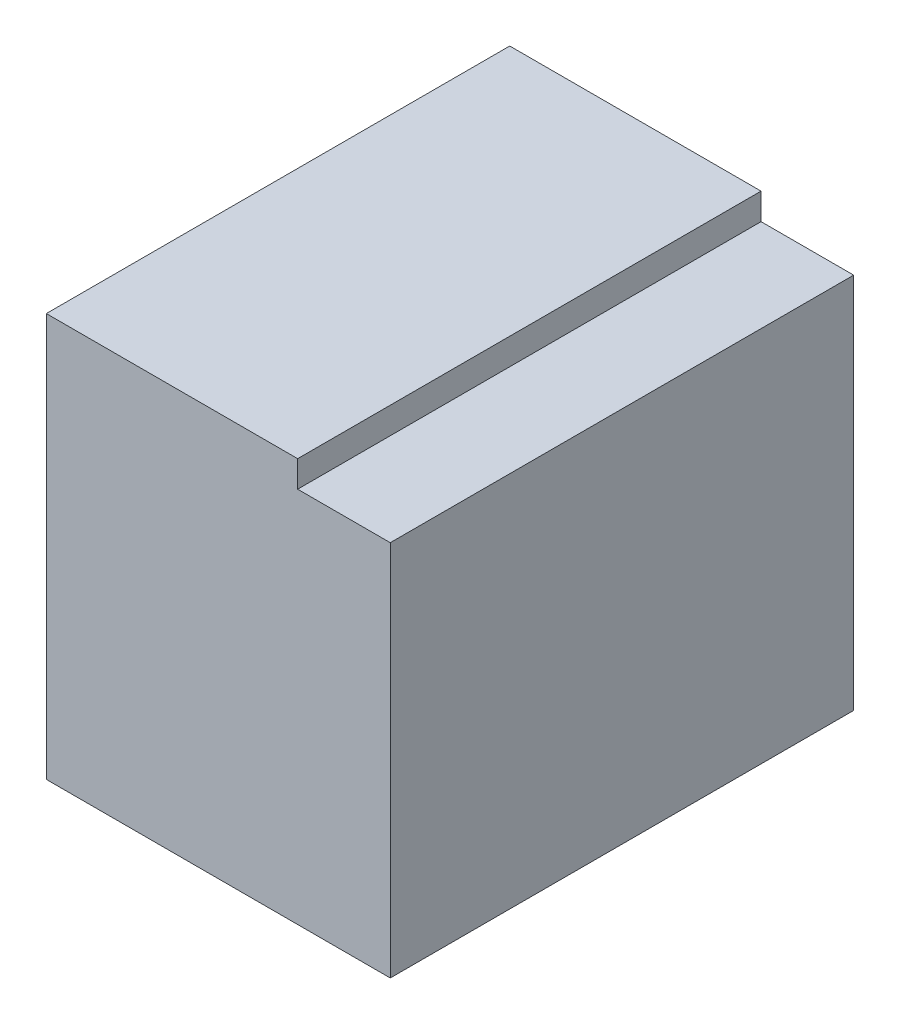
ISO-10303-21;
HEADER;
FILE_DESCRIPTION(('STEP AP214'),'2;1');
FILE_NAME('part.step','',(''),(''),'','','');
FILE_SCHEMA(('AUTOMOTIVE_DESIGN { 1 0 10303 214 1 1 1 1 }'));
ENDSEC;
DATA;
#1=APPLICATION_CONTEXT('core data for automotive mechanical design processes');
#2=APPLICATION_PROTOCOL_DEFINITION('international standard','automotive_design',2000,#1);
#3=PRODUCT_CONTEXT('',#1,'mechanical');
#4=PRODUCT('Part','Part','',(#3));
#5=PRODUCT_RELATED_PRODUCT_CATEGORY('part','',(#4));
#6=PRODUCT_DEFINITION_FORMATION('','',#4);
#7=PRODUCT_DEFINITION_CONTEXT('part definition',#1,'design');
#8=PRODUCT_DEFINITION('design','',#6,#7);
#9=PRODUCT_DEFINITION_SHAPE('','',#8);
#10=(LENGTH_UNIT() NAMED_UNIT(*) SI_UNIT(.MILLI.,.METRE.));
#11=(NAMED_UNIT(*) PLANE_ANGLE_UNIT() SI_UNIT($,.RADIAN.));
#12=(NAMED_UNIT(*) SI_UNIT($,.STERADIAN.) SOLID_ANGLE_UNIT());
#13=UNCERTAINTY_MEASURE_WITH_UNIT(LENGTH_MEASURE(1.E-05),#10,'distance_accuracy_value','');
#14=(GEOMETRIC_REPRESENTATION_CONTEXT(3) GLOBAL_UNCERTAINTY_ASSIGNED_CONTEXT((#13)) GLOBAL_UNIT_ASSIGNED_CONTEXT((#10,
#11,#12)) REPRESENTATION_CONTEXT('',''));
#15=CARTESIAN_POINT('',(0.,0.,0.));
#16=DIRECTION('',(0.,0.,1.));
#17=DIRECTION('',(1.,0.,0.));
#18=AXIS2_PLACEMENT_3D('',#15,#16,#17);
#19=CARTESIAN_POINT('',(-74.98499366421,-2.051384398449,-41.29331973764));
#20=DIRECTION('',(1.,-1.338607343168E-12,0.));
#21=DIRECTION('',(1.338607343168E-12,1.,0.));
#22=AXIS2_PLACEMENT_3D('',#19,#20,#21);
#23=PLANE('',#22);
#24=DIRECTION('',(0.,0.,1.));
#25=VECTOR('',#24,1.);
#26=CARTESIAN_POINT('',(-74.98499366421,-2.126384400525,-44.48106509227));
#27=LINE('',#26,#25);
#28=CARTESIAN_POINT('',(-74.98499366421,-2.126384400524,-47.0733197376419));
#29=VERTEX_POINT('',#28);
#30=CARTESIAN_POINT('',(-74.9849936642101,-2.12638440052275,-47.4236397376319));
#31=VERTEX_POINT('',#30);
#32=EDGE_CURVE('E79',#29,#31,#27,.F.);
#33=ORIENTED_EDGE('',*,*,#32,.T.);
#34=DIRECTION('',(0.,1.,-1.798143292204E-12));
#35=VECTOR('',#34,1.);
#36=CARTESIAN_POINT('',(-74.98499366421,-0.806384399449,-47.42363973764));
#37=LINE('',#36,#35);
#38=CARTESIAN_POINT('',(-74.9849936642099,-1.841385159389,-47.423639737432));
#39=VERTEX_POINT('',#38);
#40=EDGE_CURVE('E78',#39,#31,#37,.F.);
#41=ORIENTED_EDGE('',*,*,#40,.F.);
#42=DIRECTION('',(0.,0.,-1.));
#43=VECTOR('',#42,1.);
#44=CARTESIAN_POINT('',(-74.98499366421,-1.841385122797,-47.24863973798));
#45=LINE('',#44,#43);
#46=CARTESIAN_POINT('',(-74.9849936642099,-1.8413851696845,-47.073319737642));
#47=VERTEX_POINT('',#46);
#48=EDGE_CURVE('E19',#39,#47,#45,.F.);
#49=ORIENTED_EDGE('',*,*,#48,.T.);
#50=DIRECTION('',(0.,-1.,1.798143292204E-12));
#51=VECTOR('',#50,1.);
#52=CARTESIAN_POINT('',(-74.98499366421,-0.806384399451,-47.07331973765));
#53=LINE('',#52,#51);
#54=EDGE_CURVE('E96',#29,#47,#53,.F.);
#55=ORIENTED_EDGE('',*,*,#54,.F.);
#56=EDGE_LOOP('',(#33,#41,#49,#55));
#57=FACE_BOUND('',#56,.T.);
#58=ADVANCED_FACE('F16',(#57),#23,.T.);
#59=CARTESIAN_POINT('',(-72.39500445623,-1.841385122797,-47.24863973798));
#60=DIRECTION('',(0.,-1.,0.));
#61=DIRECTION('',(0.,0.,-1.));
#62=AXIS2_PLACEMENT_3D('',#59,#60,#61);
#63=PLANE('',#62);
#64=DIRECTION('',(1.,0.,0.));
#65=VECTOR('',#64,1.);
#66=CARTESIAN_POINT('',(-74.98500392881,-1.841385208066,-47.4236397376381));
#67=LINE('',#66,#65);
#68=CARTESIAN_POINT('',(-75.0550044696225,-1.8413851654315,-47.4236397373045));
#69=VERTEX_POINT('',#68);
#70=EDGE_CURVE('E66',#69,#39,#67,.T.);
#71=ORIENTED_EDGE('',*,*,#70,.F.);
#72=DIRECTION('',(0.,0.,1.));
#73=VECTOR('',#72,1.);
#74=CARTESIAN_POINT('',(-75.05500447043,-1.841385208066,-47.24863973798));
#75=LINE('',#74,#73);
#76=CARTESIAN_POINT('',(-75.05500447043,-1.84138516045225,-47.073319737642));
#77=VERTEX_POINT('',#76);
#78=EDGE_CURVE('E76',#69,#77,#75,.T.);
#79=ORIENTED_EDGE('',*,*,#78,.T.);
#80=DIRECTION('',(1.,0.,0.));
#81=VECTOR('',#80,1.);
#82=CARTESIAN_POINT('',(-73.12019237886,-1.841385188149,-47.0733197376481));
#83=LINE('',#82,#81);
#84=EDGE_CURVE('E72',#47,#77,#83,.F.);
#85=ORIENTED_EDGE('',*,*,#84,.F.);
#86=ORIENTED_EDGE('',*,*,#48,.F.);
#87=EDGE_LOOP('',(#71,#79,#85,#86));
#88=FACE_BOUND('',#87,.T.);
#89=ADVANCED_FACE('F70',(#88),#63,.F.);
#90=CARTESIAN_POINT('',(-75.05500447043,-1.691385382543,-47.24863973798));
#91=DIRECTION('',(-1.,0.,0.));
#92=DIRECTION('',(0.,0.,1.));
#93=AXIS2_PLACEMENT_3D('',#90,#91,#92);
#94=PLANE('',#93);
#95=DIRECTION('',(0.,-1.,1.798143292204E-12));
#96=VECTOR('',#95,1.);
#97=CARTESIAN_POINT('',(-75.05500447043,-0.806384399451,-47.07331973765));
#98=LINE('',#97,#96);
#99=CARTESIAN_POINT('',(-75.05500447043,-1.821384400506,-47.0733197376441));
#100=VERTEX_POINT('',#99);
#101=EDGE_CURVE('E99',#77,#100,#98,.F.);
#102=ORIENTED_EDGE('',*,*,#101,.F.);
#103=ORIENTED_EDGE('',*,*,#78,.F.);
#104=DIRECTION('',(0.,1.,-1.798143292204E-12));
#105=VECTOR('',#104,1.);
#106=CARTESIAN_POINT('',(-75.0550044672,-0.806384399449,-47.42363973764));
#107=LINE('',#106,#105);
#108=CARTESIAN_POINT('',(-75.0550044696225,-1.821384417642,-47.4236397372495));
#109=VERTEX_POINT('',#108);
#110=EDGE_CURVE('E82',#109,#69,#107,.F.);
#111=ORIENTED_EDGE('',*,*,#110,.F.);
#112=DIRECTION('',(0.,0.,1.));
#113=VECTOR('',#112,1.);
#114=CARTESIAN_POINT('',(-75.05500447043,-1.821384400506,-47.24863973729));
#115=LINE('',#114,#113);
#116=EDGE_CURVE('E102',#100,#109,#115,.F.);
#117=ORIENTED_EDGE('',*,*,#116,.F.);
#118=EDGE_LOOP('',(#102,#103,#111,#117));
#119=FACE_BOUND('',#118,.T.);
#120=ADVANCED_FACE('F126',(#119),#94,.F.);
#121=CARTESIAN_POINT('',(-74.98500392881,-0.806384399449,-47.42363973764));
#122=DIRECTION('',(0.,-1.798143292204E-12,-1.));
#123=DIRECTION('',(0.,1.,-1.798143292204E-12));
#124=AXIS2_PLACEMENT_3D('',#121,#122,#123);
#125=PLANE('',#124);
#126=DIRECTION('',(1.,0.,0.));
#127=VECTOR('',#126,1.);
#128=CARTESIAN_POINT('',(-72.3950044578,-1.821384400506,-47.42363973712));
#129=LINE('',#128,#127);
#130=CARTESIAN_POINT('',(-75.2450040649025,-1.821384434778,-47.4236397373941));
#131=VERTEX_POINT('',#130);
#132=EDGE_CURVE('E105',#109,#131,#129,.F.);
#133=ORIENTED_EDGE('',*,*,#132,.F.);
#134=ORIENTED_EDGE('',*,*,#110,.T.);
#135=ORIENTED_EDGE('',*,*,#70,.T.);
#136=ORIENTED_EDGE('',*,*,#40,.T.);
#137=DIRECTION('',(1.,0.,0.));
#138=VECTOR('',#137,1.);
#139=CARTESIAN_POINT('',(-72.08658338126,-2.126384400525,-47.42363973763));
#140=LINE('',#139,#138);
#141=CARTESIAN_POINT('',(-75.2450040649025,-2.12638440051725,-47.4236397375213));
#142=VERTEX_POINT('',#141);
#143=EDGE_CURVE('E91',#31,#142,#140,.F.);
#144=ORIENTED_EDGE('',*,*,#143,.T.);
#145=DIRECTION('',(0.,1.,0.));
#146=VECTOR('',#145,1.);
#147=CARTESIAN_POINT('',(-75.24500355974,-2.053616807094,-47.42363973718));
#148=LINE('',#147,#146);
#149=EDGE_CURVE('E108',#131,#142,#148,.F.);
#150=ORIENTED_EDGE('',*,*,#149,.F.);
#151=EDGE_LOOP('',(#133,#134,#135,#136,#144,#150));
#152=FACE_BOUND('',#151,.T.);
#153=ADVANCED_FACE('F86',(#152),#125,.T.);
#154=CARTESIAN_POINT('',(-72.08658338126,-2.126384400525,-44.48106509227));
#155=DIRECTION('',(0.,1.,0.));
#156=DIRECTION('',(0.,0.,1.));
#157=AXIS2_PLACEMENT_3D('',#154,#155,#156);
#158=PLANE('',#157);
#159=DIRECTION('',(0.,0.,1.));
#160=VECTOR('',#159,1.);
#161=CARTESIAN_POINT('',(-75.24500355974,-2.126384400512,-47.78847959913));
#162=LINE('',#161,#160);
#163=CARTESIAN_POINT('',(-75.245003952645,-2.12638440052075,-47.0733197376419));
#164=VERTEX_POINT('',#163);
#165=EDGE_CURVE('E111',#142,#164,#162,.T.);
#166=ORIENTED_EDGE('',*,*,#165,.F.);
#167=ORIENTED_EDGE('',*,*,#143,.F.);
#168=ORIENTED_EDGE('',*,*,#32,.F.);
#169=DIRECTION('',(1.,0.,0.));
#170=VECTOR('',#169,1.);
#171=CARTESIAN_POINT('',(-73.12019237886,-2.126384400521,-47.0733197376476));
#172=LINE('',#171,#170);
#173=EDGE_CURVE('E93',#164,#29,#172,.T.);
#174=ORIENTED_EDGE('',*,*,#173,.F.);
#175=EDGE_LOOP('',(#166,#167,#168,#174));
#176=FACE_BOUND('',#175,.T.);
#177=ADVANCED_FACE('F120',(#176),#158,.F.);
#178=CARTESIAN_POINT('',(-73.12019237886,-0.806384399451,-47.07331973765));
#179=DIRECTION('',(0.,1.798143292204E-12,1.));
#180=DIRECTION('',(0.,-1.,1.798143292204E-12));
#181=AXIS2_PLACEMENT_3D('',#178,#179,#180);
#182=PLANE('',#181);
#183=ORIENTED_EDGE('',*,*,#101,.T.);
#184=DIRECTION('',(1.,0.,0.));
#185=VECTOR('',#184,1.);
#186=CARTESIAN_POINT('',(-72.3950044578,-1.821384400506,-47.07331973764));
#187=LINE('',#186,#185);
#188=CARTESIAN_POINT('',(-75.2450038403875,-1.821384400506,-47.0733197376441));
#189=VERTEX_POINT('',#188);
#190=EDGE_CURVE('E34',#189,#100,#187,.T.);
#191=ORIENTED_EDGE('',*,*,#190,.F.);
#192=DIRECTION('',(0.,1.,0.));
#193=VECTOR('',#192,1.);
#194=CARTESIAN_POINT('',(-75.24500355974,-2.053616807094,-47.07331973764));
#195=LINE('',#194,#193);
#196=EDGE_CURVE('E25',#164,#189,#195,.T.);
#197=ORIENTED_EDGE('',*,*,#196,.F.);
#198=ORIENTED_EDGE('',*,*,#173,.T.);
#199=ORIENTED_EDGE('',*,*,#54,.T.);
#200=ORIENTED_EDGE('',*,*,#84,.T.);
#201=EDGE_LOOP('',(#183,#191,#197,#198,#199,#200));
#202=FACE_BOUND('',#201,.T.);
#203=ADVANCED_FACE('F118',(#202),#182,.T.);
#204=CARTESIAN_POINT('',(-72.3950044578,-1.821384400506,-47.24863973729));
#205=DIRECTION('',(0.,1.,0.));
#206=DIRECTION('',(0.,0.,1.));
#207=AXIS2_PLACEMENT_3D('',#204,#205,#206);
#208=PLANE('',#207);
#209=ORIENTED_EDGE('',*,*,#132,.T.);
#210=DIRECTION('',(0.,0.,1.));
#211=VECTOR('',#210,1.);
#212=CARTESIAN_POINT('',(-75.24500355974,-1.821384400506,-47.78847959913));
#213=LINE('',#212,#211);
#214=EDGE_CURVE('E11',#189,#131,#213,.F.);
#215=ORIENTED_EDGE('',*,*,#214,.F.);
#216=ORIENTED_EDGE('',*,*,#190,.T.);
#217=ORIENTED_EDGE('',*,*,#116,.T.);
#218=EDGE_LOOP('',(#209,#215,#216,#217));
#219=FACE_BOUND('',#218,.T.);
#220=ADVANCED_FACE('F122',(#219),#208,.T.);
#221=CARTESIAN_POINT('',(-75.24500355974,-2.053616807094,-47.78847959913));
#222=DIRECTION('',(-1.,0.,0.));
#223=DIRECTION('',(0.,0.,1.));
#224=AXIS2_PLACEMENT_3D('',#221,#222,#223);
#225=PLANE('',#224);
#226=ORIENTED_EDGE('',*,*,#196,.T.);
#227=ORIENTED_EDGE('',*,*,#214,.T.);
#228=ORIENTED_EDGE('',*,*,#149,.T.);
#229=ORIENTED_EDGE('',*,*,#165,.T.);
#230=EDGE_LOOP('',(#226,#227,#228,#229));
#231=FACE_BOUND('',#230,.T.);
#232=ADVANCED_FACE('F116',(#231),#225,.T.);
#233=CLOSED_SHELL('',(#58,#89,#120,#153,#177,#203,#220,#232));
#234=MANIFOLD_SOLID_BREP('B1',#233);
#235=ADVANCED_BREP_SHAPE_REPRESENTATION('',(#18,#234),#14);
#236=SHAPE_DEFINITION_REPRESENTATION(#9,#235);
ENDSEC;
END-ISO-10303-21;
